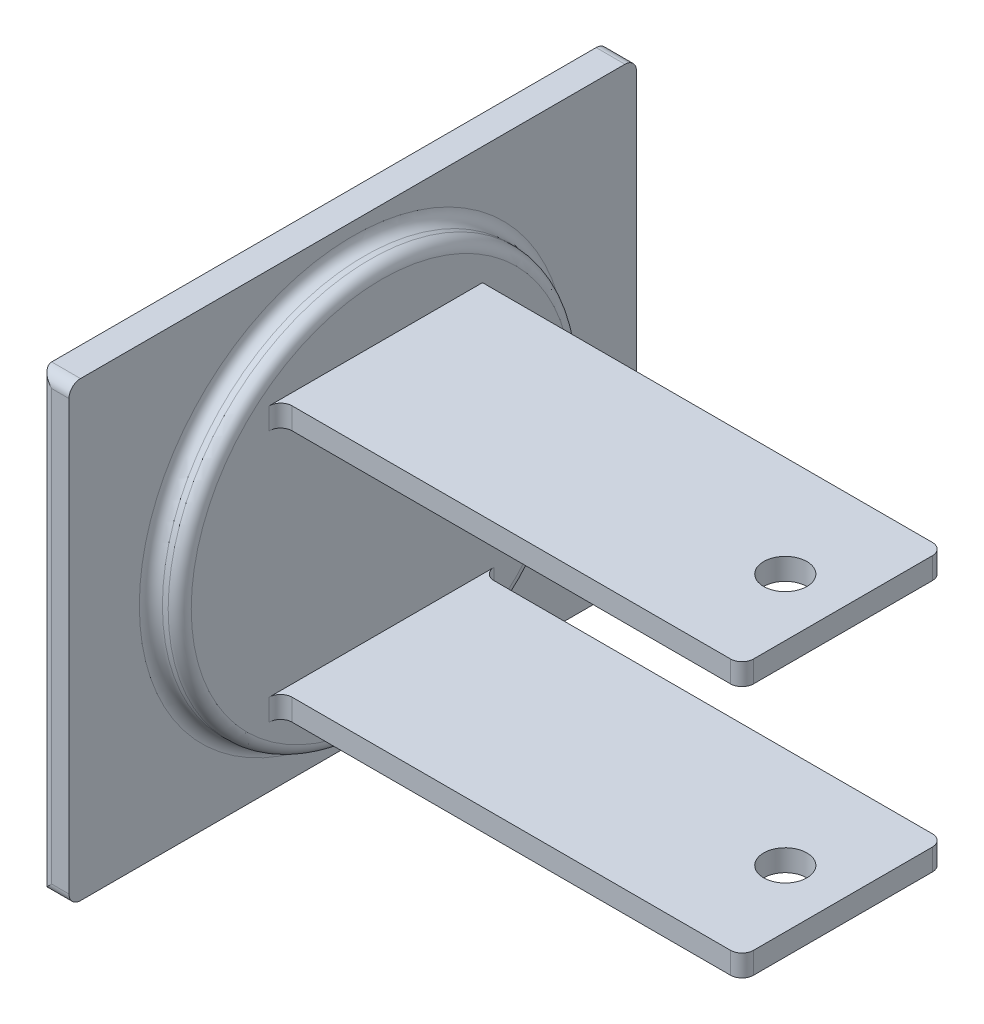
ISO-10303-21;
HEADER;
FILE_DESCRIPTION(('STEP AP214'),'2;1');
FILE_NAME('part.step','',(''),(''),'','','');
FILE_SCHEMA(('AUTOMOTIVE_DESIGN { 1 0 10303 214 1 1 1 1 }'));
ENDSEC;
DATA;
#1=APPLICATION_CONTEXT('core data for automotive mechanical design processes');
#2=APPLICATION_PROTOCOL_DEFINITION('international standard','automotive_design',2000,#1);
#3=PRODUCT_CONTEXT('',#1,'mechanical');
#4=PRODUCT('Part','Part','',(#3));
#5=PRODUCT_RELATED_PRODUCT_CATEGORY('part','',(#4));
#6=PRODUCT_DEFINITION_FORMATION('','',#4);
#7=PRODUCT_DEFINITION_CONTEXT('part definition',#1,'design');
#8=PRODUCT_DEFINITION('design','',#6,#7);
#9=PRODUCT_DEFINITION_SHAPE('','',#8);
#10=(LENGTH_UNIT() NAMED_UNIT(*) SI_UNIT(.MILLI.,.METRE.));
#11=(NAMED_UNIT(*) PLANE_ANGLE_UNIT() SI_UNIT($,.RADIAN.));
#12=(NAMED_UNIT(*) SI_UNIT($,.STERADIAN.) SOLID_ANGLE_UNIT());
#13=UNCERTAINTY_MEASURE_WITH_UNIT(LENGTH_MEASURE(1.E-05),#10,'distance_accuracy_value','');
#14=(GEOMETRIC_REPRESENTATION_CONTEXT(3) GLOBAL_UNCERTAINTY_ASSIGNED_CONTEXT((#13)) GLOBAL_UNIT_ASSIGNED_CONTEXT((#10,
#11,#12)) REPRESENTATION_CONTEXT('',''));
#15=CARTESIAN_POINT('',(0.,0.,0.));
#16=DIRECTION('',(0.,0.,1.));
#17=DIRECTION('',(1.,0.,0.));
#18=AXIS2_PLACEMENT_3D('',#15,#16,#17);
#19=CARTESIAN_POINT('',(12.7,49.784,-62.484));
#20=DIRECTION('',(1.,0.,0.));
#21=DIRECTION('',(0.,0.,-1.));
#22=AXIS2_PLACEMENT_3D('',#19,#20,#21);
#23=PLANE('',#22);
#24=CARTESIAN_POINT('',(12.7,49.784,-62.484));
#25=DIRECTION('',(1.,0.,0.));
#26=DIRECTION('',(0.,0.,-1.));
#27=AXIS2_PLACEMENT_3D('',#24,#25,#26);
#28=CIRCLE('',#27,41.91);
#29=CARTESIAN_POINT('',(12.7,49.784,-104.394));
#30=VERTEX_POINT('',#29);
#31=EDGE_CURVE('E289',#30,#30,#28,.T.);
#32=ORIENTED_EDGE('',*,*,#31,.T.);
#33=EDGE_LOOP('',(#32));
#34=FACE_BOUND('',#33,.T.);
#35=DIRECTION('',(0.,0.,-1.));
#36=VECTOR('',#35,1.);
#37=CARTESIAN_POINT('',(12.7,75.184,-40.259));
#38=LINE('',#37,#36);
#39=CARTESIAN_POINT('',(12.7,75.184,-37.719));
#40=VERTEX_POINT('',#39);
#41=CARTESIAN_POINT('',(12.7,75.184,-84.709));
#42=VERTEX_POINT('',#41);
#43=EDGE_CURVE('E219',#40,#42,#38,.T.);
#44=ORIENTED_EDGE('',*,*,#43,.F.);
#45=DIRECTION('',(0.,-1.,0.));
#46=VECTOR('',#45,1.);
#47=CARTESIAN_POINT('',(12.7,49.784,-37.719));
#48=LINE('',#47,#46);
#49=CARTESIAN_POINT('',(12.7,79.9465,-37.719));
#50=VERTEX_POINT('',#49);
#51=EDGE_CURVE('E217',#40,#50,#48,.F.);
#52=ORIENTED_EDGE('',*,*,#51,.T.);
#53=DIRECTION('',(0.,0.,1.));
#54=VECTOR('',#53,1.);
#55=CARTESIAN_POINT('',(12.7,79.9465,-40.259));
#56=LINE('',#55,#54);
#57=CARTESIAN_POINT('',(12.7,79.9465,-84.709));
#58=VERTEX_POINT('',#57);
#59=EDGE_CURVE('E197',#58,#50,#56,.T.);
#60=ORIENTED_EDGE('',*,*,#59,.F.);
#61=DIRECTION('',(0.,1.,0.));
#62=VECTOR('',#61,1.);
#63=CARTESIAN_POINT('',(12.7,79.9465,-84.709));
#64=LINE('',#63,#62);
#65=EDGE_CURVE('E207',#42,#58,#64,.T.);
#66=ORIENTED_EDGE('',*,*,#65,.F.);
#67=EDGE_LOOP('',(#44,#52,#60,#66));
#68=FACE_BOUND('',#67,.T.);
#69=DIRECTION('',(0.,0.,1.));
#70=VECTOR('',#69,1.);
#71=CARTESIAN_POINT('',(12.7,24.384,-40.259));
#72=LINE('',#71,#70);
#73=CARTESIAN_POINT('',(12.7,24.384,-87.249));
#74=VERTEX_POINT('',#73);
#75=CARTESIAN_POINT('',(12.7,24.384,-37.719));
#76=VERTEX_POINT('',#75);
#77=EDGE_CURVE('E381',#74,#76,#72,.T.);
#78=ORIENTED_EDGE('',*,*,#77,.F.);
#79=DIRECTION('',(0.,1.,0.));
#80=VECTOR('',#79,1.);
#81=CARTESIAN_POINT('',(12.7,49.784,-87.249));
#82=LINE('',#81,#80);
#83=CARTESIAN_POINT('',(12.7,19.6215,-87.249));
#84=VERTEX_POINT('',#83);
#85=EDGE_CURVE('E286',#74,#84,#82,.F.);
#86=ORIENTED_EDGE('',*,*,#85,.T.);
#87=DIRECTION('',(0.,0.,-1.));
#88=VECTOR('',#87,1.);
#89=CARTESIAN_POINT('',(12.7,19.6215,-40.259));
#90=LINE('',#89,#88);
#91=CARTESIAN_POINT('',(12.7,19.6215,-37.719));
#92=VERTEX_POINT('',#91);
#93=EDGE_CURVE('E386',#92,#84,#90,.T.);
#94=ORIENTED_EDGE('',*,*,#93,.F.);
#95=DIRECTION('',(0.,-1.,0.));
#96=VECTOR('',#95,1.);
#97=CARTESIAN_POINT('',(12.7,49.784,-37.719));
#98=LINE('',#97,#96);
#99=EDGE_CURVE('E283',#92,#76,#98,.F.);
#100=ORIENTED_EDGE('',*,*,#99,.T.);
#101=EDGE_LOOP('',(#78,#86,#94,#100));
#102=FACE_BOUND('',#101,.T.);
#103=ADVANCED_FACE('F34',(#34,#68,#102),#23,.T.);
#104=CARTESIAN_POINT('',(6.35,0.,0.));
#105=DIRECTION('',(0.,0.,-1.));
#106=DIRECTION('',(0.,1.,0.));
#107=AXIS2_PLACEMENT_3D('',#104,#105,#106);
#108=PLANE('',#107);
#109=DIRECTION('',(0.,-1.,0.));
#110=VECTOR('',#109,1.);
#111=CARTESIAN_POINT('',(2.54,0.,0.));
#112=LINE('',#111,#110);
#113=CARTESIAN_POINT('',(2.54,97.028,0.));
#114=VERTEX_POINT('',#113);
#115=CARTESIAN_POINT('',(2.54,2.54,0.));
#116=VERTEX_POINT('',#115);
#117=EDGE_CURVE('E271',#114,#116,#112,.T.);
#118=ORIENTED_EDGE('',*,*,#117,.T.);
#119=DIRECTION('',(-1.,0.,0.));
#120=VECTOR('',#119,1.);
#121=CARTESIAN_POINT('',(6.35,2.54,0.));
#122=LINE('',#121,#120);
#123=CARTESIAN_POINT('',(6.35,2.54,0.));
#124=VERTEX_POINT('',#123);
#125=EDGE_CURVE('E274',#116,#124,#122,.F.);
#126=ORIENTED_EDGE('',*,*,#125,.T.);
#127=DIRECTION('',(0.,-1.,0.));
#128=VECTOR('',#127,1.);
#129=CARTESIAN_POINT('',(6.35,0.,0.));
#130=LINE('',#129,#128);
#131=CARTESIAN_POINT('',(6.35,97.028,0.));
#132=VERTEX_POINT('',#131);
#133=EDGE_CURVE('E232',#132,#124,#130,.T.);
#134=ORIENTED_EDGE('',*,*,#133,.F.);
#135=DIRECTION('',(-1.,0.,0.));
#136=VECTOR('',#135,1.);
#137=CARTESIAN_POINT('',(6.35,97.028,0.));
#138=LINE('',#137,#136);
#139=EDGE_CURVE('E269',#132,#114,#138,.T.);
#140=ORIENTED_EDGE('',*,*,#139,.T.);
#141=EDGE_LOOP('',(#118,#126,#134,#140));
#142=FACE_BOUND('',#141,.T.);
#143=ADVANCED_FACE('F435',(#142),#108,.F.);
#144=CARTESIAN_POINT('',(6.35,0.,0.));
#145=DIRECTION('',(0.,1.,0.));
#146=DIRECTION('',(0.,0.,1.));
#147=AXIS2_PLACEMENT_3D('',#144,#145,#146);
#148=PLANE('',#147);
#149=DIRECTION('',(0.,0.,-1.));
#150=VECTOR('',#149,1.);
#151=CARTESIAN_POINT('',(6.35,0.,0.));
#152=LINE('',#151,#150);
#153=CARTESIAN_POINT('',(6.35,0.,-2.54));
#154=VERTEX_POINT('',#153);
#155=CARTESIAN_POINT('',(6.35,0.,-122.428));
#156=VERTEX_POINT('',#155);
#157=EDGE_CURVE('E235',#154,#156,#152,.T.);
#158=ORIENTED_EDGE('',*,*,#157,.F.);
#159=DIRECTION('',(-1.,0.,0.));
#160=VECTOR('',#159,1.);
#161=CARTESIAN_POINT('',(6.35,0.,-2.54));
#162=LINE('',#161,#160);
#163=CARTESIAN_POINT('',(0.,0.,-2.54));
#164=VERTEX_POINT('',#163);
#165=EDGE_CURVE('E333',#154,#164,#162,.T.);
#166=ORIENTED_EDGE('',*,*,#165,.T.);
#167=DIRECTION('',(0.,0.,-1.));
#168=VECTOR('',#167,1.);
#169=CARTESIAN_POINT('',(0.,0.,0.));
#170=LINE('',#169,#168);
#171=CARTESIAN_POINT('',(0.,0.,-122.428));
#172=VERTEX_POINT('',#171);
#173=EDGE_CURVE('E203',#164,#172,#170,.T.);
#174=ORIENTED_EDGE('',*,*,#173,.T.);
#175=DIRECTION('',(-1.,0.,0.));
#176=VECTOR('',#175,1.);
#177=CARTESIAN_POINT('',(6.35,0.,-122.428));
#178=LINE('',#177,#176);
#179=EDGE_CURVE('E331',#172,#156,#178,.F.);
#180=ORIENTED_EDGE('',*,*,#179,.T.);
#181=EDGE_LOOP('',(#158,#166,#174,#180));
#182=FACE_BOUND('',#181,.T.);
#183=ADVANCED_FACE('F441',(#182),#148,.F.);
#184=CARTESIAN_POINT('',(6.35,0.,-124.968));
#185=DIRECTION('',(0.,0.,1.));
#186=DIRECTION('',(0.,-1.,0.));
#187=AXIS2_PLACEMENT_3D('',#184,#185,#186);
#188=PLANE('',#187);
#189=DIRECTION('',(0.,1.,0.));
#190=VECTOR('',#189,1.);
#191=CARTESIAN_POINT('',(6.35,0.,-124.968));
#192=LINE('',#191,#190);
#193=CARTESIAN_POINT('',(6.35,2.54,-124.968));
#194=VERTEX_POINT('',#193);
#195=CARTESIAN_POINT('',(6.35,97.028,-124.968));
#196=VERTEX_POINT('',#195);
#197=EDGE_CURVE('E239',#194,#196,#192,.T.);
#198=ORIENTED_EDGE('',*,*,#197,.F.);
#199=DIRECTION('',(-1.,0.,0.));
#200=VECTOR('',#199,1.);
#201=CARTESIAN_POINT('',(6.35,2.54,-124.968));
#202=LINE('',#201,#200);
#203=CARTESIAN_POINT('',(0.,2.54,-124.968));
#204=VERTEX_POINT('',#203);
#205=EDGE_CURVE('E339',#194,#204,#202,.T.);
#206=ORIENTED_EDGE('',*,*,#205,.T.);
#207=DIRECTION('',(0.,1.,0.));
#208=VECTOR('',#207,1.);
#209=CARTESIAN_POINT('',(0.,0.,-124.968));
#210=LINE('',#209,#208);
#211=CARTESIAN_POINT('',(0.,97.028,-124.968));
#212=VERTEX_POINT('',#211);
#213=EDGE_CURVE('E248',#204,#212,#210,.T.);
#214=ORIENTED_EDGE('',*,*,#213,.T.);
#215=DIRECTION('',(-1.,0.,0.));
#216=VECTOR('',#215,1.);
#217=CARTESIAN_POINT('',(6.35,97.028,-124.968));
#218=LINE('',#217,#216);
#219=EDGE_CURVE('E337',#212,#196,#218,.F.);
#220=ORIENTED_EDGE('',*,*,#219,.T.);
#221=EDGE_LOOP('',(#198,#206,#214,#220));
#222=FACE_BOUND('',#221,.T.);
#223=ADVANCED_FACE('F462',(#222),#188,.F.);
#224=CARTESIAN_POINT('',(6.35,99.568,0.));
#225=DIRECTION('',(0.,-1.,0.));
#226=DIRECTION('',(0.,0.,-1.));
#227=AXIS2_PLACEMENT_3D('',#224,#225,#226);
#228=PLANE('',#227);
#229=DIRECTION('',(0.,0.,1.));
#230=VECTOR('',#229,1.);
#231=CARTESIAN_POINT('',(0.,99.568,0.));
#232=LINE('',#231,#230);
#233=CARTESIAN_POINT('',(0.,99.568,-122.428));
#234=VERTEX_POINT('',#233);
#235=CARTESIAN_POINT('',(0.,99.568,-2.53999999999999));
#236=VERTEX_POINT('',#235);
#237=EDGE_CURVE('E236',#234,#236,#232,.T.);
#238=ORIENTED_EDGE('',*,*,#237,.T.);
#239=DIRECTION('',(-1.,0.,0.));
#240=VECTOR('',#239,1.);
#241=CARTESIAN_POINT('',(6.35,99.568,-2.53999999999999));
#242=LINE('',#241,#240);
#243=CARTESIAN_POINT('',(6.35,99.568,-2.53999999999999));
#244=VERTEX_POINT('',#243);
#245=EDGE_CURVE('E345',#236,#244,#242,.F.);
#246=ORIENTED_EDGE('',*,*,#245,.T.);
#247=DIRECTION('',(0.,0.,1.));
#248=VECTOR('',#247,1.);
#249=CARTESIAN_POINT('',(6.35,99.568,0.));
#250=LINE('',#249,#248);
#251=CARTESIAN_POINT('',(6.35,99.568,-122.428));
#252=VERTEX_POINT('',#251);
#253=EDGE_CURVE('E242',#252,#244,#250,.T.);
#254=ORIENTED_EDGE('',*,*,#253,.F.);
#255=DIRECTION('',(-1.,0.,0.));
#256=VECTOR('',#255,1.);
#257=CARTESIAN_POINT('',(6.35,99.568,-122.428));
#258=LINE('',#257,#256);
#259=EDGE_CURVE('E342',#252,#234,#258,.T.);
#260=ORIENTED_EDGE('',*,*,#259,.T.);
#261=EDGE_LOOP('',(#238,#246,#254,#260));
#262=FACE_BOUND('',#261,.T.);
#263=ADVANCED_FACE('F455',(#262),#228,.F.);
#264=CARTESIAN_POINT('',(6.35,0.,0.));
#265=DIRECTION('',(-1.,0.,0.));
#266=DIRECTION('',(0.,0.,1.));
#267=AXIS2_PLACEMENT_3D('',#264,#265,#266);
#268=PLANE('',#267);
#269=CARTESIAN_POINT('',(6.35,49.784,-62.484));
#270=DIRECTION('',(-1.,0.,0.));
#271=DIRECTION('',(0.,0.,1.));
#272=AXIS2_PLACEMENT_3D('',#269,#270,#271);
#273=CIRCLE('',#272,46.99);
#274=CARTESIAN_POINT('',(6.35,49.784,-15.494));
#275=VERTEX_POINT('',#274);
#276=EDGE_CURVE('E266',#275,#275,#273,.T.);
#277=ORIENTED_EDGE('',*,*,#276,.T.);
#278=EDGE_LOOP('',(#277));
#279=FACE_BOUND('',#278,.T.);
#280=ORIENTED_EDGE('',*,*,#133,.T.);
#281=CARTESIAN_POINT('',(6.35,2.54,-2.54));
#282=DIRECTION('',(-1.,0.,0.));
#283=DIRECTION('',(0.,0.,1.));
#284=AXIS2_PLACEMENT_3D('',#281,#282,#283);
#285=CIRCLE('',#284,2.54);
#286=EDGE_CURVE('E264',#124,#154,#285,.F.);
#287=ORIENTED_EDGE('',*,*,#286,.T.);
#288=ORIENTED_EDGE('',*,*,#157,.T.);
#289=CARTESIAN_POINT('',(6.35,2.54,-122.428));
#290=DIRECTION('',(-1.,0.,0.));
#291=DIRECTION('',(0.,0.,1.));
#292=AXIS2_PLACEMENT_3D('',#289,#290,#291);
#293=CIRCLE('',#292,2.54);
#294=EDGE_CURVE('E262',#156,#194,#293,.F.);
#295=ORIENTED_EDGE('',*,*,#294,.T.);
#296=ORIENTED_EDGE('',*,*,#197,.T.);
#297=CARTESIAN_POINT('',(6.35,97.028,-122.428));
#298=DIRECTION('',(-1.,0.,0.));
#299=DIRECTION('',(0.,0.,1.));
#300=AXIS2_PLACEMENT_3D('',#297,#298,#299);
#301=CIRCLE('',#300,2.54);
#302=EDGE_CURVE('E258',#196,#252,#301,.F.);
#303=ORIENTED_EDGE('',*,*,#302,.T.);
#304=ORIENTED_EDGE('',*,*,#253,.T.);
#305=CARTESIAN_POINT('',(6.35,97.028,-2.53999999999999));
#306=DIRECTION('',(-1.,0.,0.));
#307=DIRECTION('',(0.,0.,1.));
#308=AXIS2_PLACEMENT_3D('',#305,#306,#307);
#309=CIRCLE('',#308,2.54);
#310=EDGE_CURVE('E260',#244,#132,#309,.F.);
#311=ORIENTED_EDGE('',*,*,#310,.T.);
#312=EDGE_LOOP('',(#280,#287,#288,#295,#296,#303,#304,#311));
#313=FACE_BOUND('',#312,.T.);
#314=ADVANCED_FACE('F452',(#279,#313),#268,.F.);
#315=CARTESIAN_POINT('',(0.,0.,0.));
#316=DIRECTION('',(-1.,0.,0.));
#317=DIRECTION('',(0.,0.,1.));
#318=AXIS2_PLACEMENT_3D('',#315,#316,#317);
#319=PLANE('',#318);
#320=ORIENTED_EDGE('',*,*,#173,.F.);
#321=DIRECTION('',(0.,-1.,0.));
#322=VECTOR('',#321,1.);
#323=CARTESIAN_POINT('',(0.,99.568,-2.53999999999999));
#324=LINE('',#323,#322);
#325=EDGE_CURVE('E280',#164,#236,#324,.F.);
#326=ORIENTED_EDGE('',*,*,#325,.T.);
#327=ORIENTED_EDGE('',*,*,#237,.F.);
#328=CARTESIAN_POINT('',(0.,97.028,-122.428));
#329=DIRECTION('',(-1.,0.,0.));
#330=DIRECTION('',(0.,0.,1.));
#331=AXIS2_PLACEMENT_3D('',#328,#329,#330);
#332=CIRCLE('',#331,2.54);
#333=EDGE_CURVE('E276',#234,#212,#332,.T.);
#334=ORIENTED_EDGE('',*,*,#333,.T.);
#335=ORIENTED_EDGE('',*,*,#213,.F.);
#336=CARTESIAN_POINT('',(0.,2.54,-122.428));
#337=DIRECTION('',(-1.,0.,0.));
#338=DIRECTION('',(0.,0.,1.));
#339=AXIS2_PLACEMENT_3D('',#336,#337,#338);
#340=CIRCLE('',#339,2.54);
#341=EDGE_CURVE('E278',#204,#172,#340,.T.);
#342=ORIENTED_EDGE('',*,*,#341,.T.);
#343=EDGE_LOOP('',(#320,#326,#327,#334,#335,#342));
#344=FACE_BOUND('',#343,.T.);
#345=ADVANCED_FACE('F450',(#344),#319,.T.);
#346=CARTESIAN_POINT('',(12.7,49.784,-62.484));
#347=DIRECTION('',(-1.,0.,0.));
#348=DIRECTION('',(0.,0.,1.));
#349=AXIS2_PLACEMENT_3D('',#346,#347,#348);
#350=CYLINDRICAL_SURFACE('',#349,44.45);
#351=CARTESIAN_POINT('',(8.89,49.784,-62.484));
#352=DIRECTION('',(-1.,0.,0.));
#353=DIRECTION('',(0.,0.,1.));
#354=AXIS2_PLACEMENT_3D('',#351,#352,#353);
#355=CIRCLE('',#354,44.45);
#356=CARTESIAN_POINT('',(8.89,49.784,-18.034));
#357=VERTEX_POINT('',#356);
#358=EDGE_CURVE('E255',#357,#357,#355,.F.);
#359=ORIENTED_EDGE('',*,*,#358,.T.);
#360=EDGE_LOOP('',(#359));
#361=FACE_BOUND('',#360,.T.);
#362=CARTESIAN_POINT('',(10.16,49.784,-62.484));
#363=DIRECTION('',(1.,0.,0.));
#364=DIRECTION('',(0.,0.,-1.));
#365=AXIS2_PLACEMENT_3D('',#362,#363,#364);
#366=CIRCLE('',#365,44.45);
#367=CARTESIAN_POINT('',(10.16,49.784,-106.934));
#368=VERTEX_POINT('',#367);
#369=EDGE_CURVE('E245',#368,#368,#366,.F.);
#370=ORIENTED_EDGE('',*,*,#369,.T.);
#371=EDGE_LOOP('',(#370));
#372=FACE_BOUND('',#371,.T.);
#373=ADVANCED_FACE('F447',(#361,#372),#350,.T.);
#374=CARTESIAN_POINT('',(114.3,79.9465,-84.709));
#375=DIRECTION('',(0.,0.,1.));
#376=DIRECTION('',(1.,0.,0.));
#377=AXIS2_PLACEMENT_3D('',#374,#375,#376);
#378=PLANE('',#377);
#379=DIRECTION('',(-1.,0.,0.));
#380=VECTOR('',#379,1.);
#381=CARTESIAN_POINT('',(114.3,79.9465,-84.709));
#382=LINE('',#381,#380);
#383=CARTESIAN_POINT('',(111.76,79.9465,-84.709));
#384=VERTEX_POINT('',#383);
#385=EDGE_CURVE('E192',#384,#58,#382,.T.);
#386=ORIENTED_EDGE('',*,*,#385,.F.);
#387=DIRECTION('',(0.,1.,0.));
#388=VECTOR('',#387,1.);
#389=CARTESIAN_POINT('',(111.76,75.184,-84.709));
#390=LINE('',#389,#388);
#391=CARTESIAN_POINT('',(111.76,75.184,-84.709));
#392=VERTEX_POINT('',#391);
#393=EDGE_CURVE('E335',#384,#392,#390,.F.);
#394=ORIENTED_EDGE('',*,*,#393,.T.);
#395=DIRECTION('',(-1.,0.,0.));
#396=VECTOR('',#395,1.);
#397=CARTESIAN_POINT('',(114.3,75.184,-84.709));
#398=LINE('',#397,#396);
#399=EDGE_CURVE('E210',#392,#42,#398,.T.);
#400=ORIENTED_EDGE('',*,*,#399,.T.);
#401=ORIENTED_EDGE('',*,*,#65,.T.);
#402=EDGE_LOOP('',(#386,#394,#400,#401));
#403=FACE_BOUND('',#402,.T.);
#404=ADVANCED_FACE('F208',(#403),#378,.F.);
#405=CARTESIAN_POINT('',(114.3,79.9465,-40.259));
#406=DIRECTION('',(0.,-1.,0.));
#407=DIRECTION('',(0.,0.,-1.));
#408=AXIS2_PLACEMENT_3D('',#405,#406,#407);
#409=PLANE('',#408);
#410=CARTESIAN_POINT('',(101.6,79.9465,-62.484));
#411=DIRECTION('',(0.,-1.,0.));
#412=DIRECTION('',(0.,0.,-1.));
#413=AXIS2_PLACEMENT_3D('',#410,#411,#412);
#414=CIRCLE('',#413,4.7625);
#415=CARTESIAN_POINT('',(101.6,79.9465,-67.2465));
#416=VERTEX_POINT('',#415);
#417=EDGE_CURVE('E378',#416,#416,#414,.T.);
#418=ORIENTED_EDGE('',*,*,#417,.T.);
#419=EDGE_LOOP('',(#418));
#420=FACE_BOUND('',#419,.T.);
#421=DIRECTION('',(-1.,0.,0.));
#422=VECTOR('',#421,1.);
#423=CARTESIAN_POINT('',(114.3,79.9465,-40.259));
#424=LINE('',#423,#422);
#425=CARTESIAN_POINT('',(111.76,79.9465,-40.259));
#426=VERTEX_POINT('',#425);
#427=CARTESIAN_POINT('',(15.24,79.9465,-40.259));
#428=VERTEX_POINT('',#427);
#429=EDGE_CURVE('E204',#426,#428,#424,.T.);
#430=ORIENTED_EDGE('',*,*,#429,.F.);
#431=CARTESIAN_POINT('',(111.76,79.9465,-42.799));
#432=DIRECTION('',(0.,-1.,0.));
#433=DIRECTION('',(0.,0.,-1.));
#434=AXIS2_PLACEMENT_3D('',#431,#432,#433);
#435=CIRCLE('',#434,2.54);
#436=CARTESIAN_POINT('',(114.3,79.9465,-42.799));
#437=VERTEX_POINT('',#436);
#438=EDGE_CURVE('E318',#426,#437,#435,.F.);
#439=ORIENTED_EDGE('',*,*,#438,.T.);
#440=DIRECTION('',(0.,0.,1.));
#441=VECTOR('',#440,1.);
#442=CARTESIAN_POINT('',(114.3,79.9465,-40.259));
#443=LINE('',#442,#441);
#444=CARTESIAN_POINT('',(114.3,79.9465,-82.169));
#445=VERTEX_POINT('',#444);
#446=EDGE_CURVE('E221',#445,#437,#443,.T.);
#447=ORIENTED_EDGE('',*,*,#446,.F.);
#448=CARTESIAN_POINT('',(111.76,79.9465,-82.169));
#449=DIRECTION('',(0.,-1.,0.));
#450=DIRECTION('',(0.,0.,-1.));
#451=AXIS2_PLACEMENT_3D('',#448,#449,#450);
#452=CIRCLE('',#451,2.54);
#453=EDGE_CURVE('E200',#445,#384,#452,.F.);
#454=ORIENTED_EDGE('',*,*,#453,.T.);
#455=ORIENTED_EDGE('',*,*,#385,.T.);
#456=ORIENTED_EDGE('',*,*,#59,.T.);
#457=CARTESIAN_POINT('',(15.24,79.9465,-37.719));
#458=DIRECTION('',(0.,-1.,0.));
#459=DIRECTION('',(0.,0.,-1.));
#460=AXIS2_PLACEMENT_3D('',#457,#458,#459);
#461=CIRCLE('',#460,2.54);
#462=EDGE_CURVE('E11',#50,#428,#461,.T.);
#463=ORIENTED_EDGE('',*,*,#462,.T.);
#464=EDGE_LOOP('',(#430,#439,#447,#454,#455,#456,#463));
#465=FACE_BOUND('',#464,.T.);
#466=ADVANCED_FACE('F195',(#420,#465),#409,.F.);
#467=CARTESIAN_POINT('',(114.3,79.9465,-40.259));
#468=DIRECTION('',(0.,0.,-1.));
#469=DIRECTION('',(-1.,0.,0.));
#470=AXIS2_PLACEMENT_3D('',#467,#468,#469);
#471=PLANE('',#470);
#472=ORIENTED_EDGE('',*,*,#429,.T.);
#473=DIRECTION('',(0.,-1.,0.));
#474=VECTOR('',#473,1.);
#475=CARTESIAN_POINT('',(15.24,79.9465,-40.259));
#476=LINE('',#475,#474);
#477=CARTESIAN_POINT('',(15.24,75.184,-40.259));
#478=VERTEX_POINT('',#477);
#479=EDGE_CURVE('E304',#428,#478,#476,.T.);
#480=ORIENTED_EDGE('',*,*,#479,.T.);
#481=DIRECTION('',(-1.,0.,0.));
#482=VECTOR('',#481,1.);
#483=CARTESIAN_POINT('',(114.3,75.184,-40.259));
#484=LINE('',#483,#482);
#485=CARTESIAN_POINT('',(111.76,75.184,-40.259));
#486=VERTEX_POINT('',#485);
#487=EDGE_CURVE('E226',#486,#478,#484,.T.);
#488=ORIENTED_EDGE('',*,*,#487,.F.);
#489=DIRECTION('',(0.,-1.,0.));
#490=VECTOR('',#489,1.);
#491=CARTESIAN_POINT('',(111.76,79.9465,-40.259));
#492=LINE('',#491,#490);
#493=EDGE_CURVE('E302',#486,#426,#492,.F.);
#494=ORIENTED_EDGE('',*,*,#493,.T.);
#495=EDGE_LOOP('',(#472,#480,#488,#494));
#496=FACE_BOUND('',#495,.T.);
#497=ADVANCED_FACE('F419',(#496),#471,.F.);
#498=CARTESIAN_POINT('',(114.3,75.184,-40.259));
#499=DIRECTION('',(0.,1.,0.));
#500=DIRECTION('',(0.,0.,1.));
#501=AXIS2_PLACEMENT_3D('',#498,#499,#500);
#502=PLANE('',#501);
#503=CARTESIAN_POINT('',(101.6,75.184,-62.484));
#504=DIRECTION('',(0.,1.,0.));
#505=DIRECTION('',(0.,0.,1.));
#506=AXIS2_PLACEMENT_3D('',#503,#504,#505);
#507=CIRCLE('',#506,4.7625);
#508=CARTESIAN_POINT('',(101.6,75.184,-57.7215));
#509=VERTEX_POINT('',#508);
#510=EDGE_CURVE('E373',#509,#509,#507,.T.);
#511=ORIENTED_EDGE('',*,*,#510,.T.);
#512=EDGE_LOOP('',(#511));
#513=FACE_BOUND('',#512,.T.);
#514=DIRECTION('',(0.,0.,-1.));
#515=VECTOR('',#514,1.);
#516=CARTESIAN_POINT('',(114.3,75.184,-40.259));
#517=LINE('',#516,#515);
#518=CARTESIAN_POINT('',(114.3,75.184,-42.799));
#519=VERTEX_POINT('',#518);
#520=CARTESIAN_POINT('',(114.3,75.184,-82.169));
#521=VERTEX_POINT('',#520);
#522=EDGE_CURVE('E227',#519,#521,#517,.T.);
#523=ORIENTED_EDGE('',*,*,#522,.F.);
#524=CARTESIAN_POINT('',(111.76,75.184,-42.799));
#525=DIRECTION('',(0.,1.,0.));
#526=DIRECTION('',(0.,0.,1.));
#527=AXIS2_PLACEMENT_3D('',#524,#525,#526);
#528=CIRCLE('',#527,2.54);
#529=EDGE_CURVE('E315',#519,#486,#528,.F.);
#530=ORIENTED_EDGE('',*,*,#529,.T.);
#531=ORIENTED_EDGE('',*,*,#487,.T.);
#532=CARTESIAN_POINT('',(15.24,75.184,-37.719));
#533=DIRECTION('',(0.,1.,0.));
#534=DIRECTION('',(0.,0.,1.));
#535=AXIS2_PLACEMENT_3D('',#532,#533,#534);
#536=CIRCLE('',#535,2.54);
#537=EDGE_CURVE('E43',#478,#40,#536,.T.);
#538=ORIENTED_EDGE('',*,*,#537,.T.);
#539=ORIENTED_EDGE('',*,*,#43,.T.);
#540=ORIENTED_EDGE('',*,*,#399,.F.);
#541=CARTESIAN_POINT('',(111.76,75.184,-82.169));
#542=DIRECTION('',(0.,1.,0.));
#543=DIRECTION('',(0.,0.,1.));
#544=AXIS2_PLACEMENT_3D('',#541,#542,#543);
#545=CIRCLE('',#544,2.54);
#546=EDGE_CURVE('E313',#392,#521,#545,.F.);
#547=ORIENTED_EDGE('',*,*,#546,.T.);
#548=EDGE_LOOP('',(#523,#530,#531,#538,#539,#540,#547));
#549=FACE_BOUND('',#548,.T.);
#550=ADVANCED_FACE('F412',(#513,#549),#502,.F.);
#551=CARTESIAN_POINT('',(114.3,0.,0.));
#552=DIRECTION('',(1.,0.,0.));
#553=DIRECTION('',(0.,0.,-1.));
#554=AXIS2_PLACEMENT_3D('',#551,#552,#553);
#555=PLANE('',#554);
#556=ORIENTED_EDGE('',*,*,#446,.T.);
#557=DIRECTION('',(0.,-1.,0.));
#558=VECTOR('',#557,1.);
#559=CARTESIAN_POINT('',(114.3,75.184,-42.799));
#560=LINE('',#559,#558);
#561=EDGE_CURVE('E310',#437,#519,#560,.T.);
#562=ORIENTED_EDGE('',*,*,#561,.T.);
#563=ORIENTED_EDGE('',*,*,#522,.T.);
#564=DIRECTION('',(0.,1.,0.));
#565=VECTOR('',#564,1.);
#566=CARTESIAN_POINT('',(114.3,79.9465,-82.169));
#567=LINE('',#566,#565);
#568=EDGE_CURVE('E307',#521,#445,#567,.T.);
#569=ORIENTED_EDGE('',*,*,#568,.T.);
#570=EDGE_LOOP('',(#556,#562,#563,#569));
#571=FACE_BOUND('',#570,.T.);
#572=ADVANCED_FACE('F406',(#571),#555,.T.);
#573=CARTESIAN_POINT('',(114.3,19.6215,-84.709));
#574=DIRECTION('',(0.,0.,1.));
#575=DIRECTION('',(1.,0.,0.));
#576=AXIS2_PLACEMENT_3D('',#573,#574,#575);
#577=PLANE('',#576);
#578=DIRECTION('',(-1.,0.,0.));
#579=VECTOR('',#578,1.);
#580=CARTESIAN_POINT('',(114.3,19.6215,-84.709));
#581=LINE('',#580,#579);
#582=CARTESIAN_POINT('',(111.76,19.6215,-84.709));
#583=VERTEX_POINT('',#582);
#584=CARTESIAN_POINT('',(15.24,19.6215,-84.709));
#585=VERTEX_POINT('',#584);
#586=EDGE_CURVE('E388',#583,#585,#581,.T.);
#587=ORIENTED_EDGE('',*,*,#586,.T.);
#588=DIRECTION('',(0.,1.,0.));
#589=VECTOR('',#588,1.);
#590=CARTESIAN_POINT('',(15.24,19.6215,-84.709));
#591=LINE('',#590,#589);
#592=CARTESIAN_POINT('',(15.24,24.384,-84.709));
#593=VERTEX_POINT('',#592);
#594=EDGE_CURVE('E294',#585,#593,#591,.T.);
#595=ORIENTED_EDGE('',*,*,#594,.T.);
#596=DIRECTION('',(-1.,0.,0.));
#597=VECTOR('',#596,1.);
#598=CARTESIAN_POINT('',(114.3,24.384,-84.709));
#599=LINE('',#598,#597);
#600=CARTESIAN_POINT('',(111.76,24.384,-84.709));
#601=VERTEX_POINT('',#600);
#602=EDGE_CURVE('E213',#601,#593,#599,.T.);
#603=ORIENTED_EDGE('',*,*,#602,.F.);
#604=DIRECTION('',(0.,1.,0.));
#605=VECTOR('',#604,1.);
#606=CARTESIAN_POINT('',(111.76,19.6215,-84.709));
#607=LINE('',#606,#605);
#608=EDGE_CURVE('E292',#601,#583,#607,.F.);
#609=ORIENTED_EDGE('',*,*,#608,.T.);
#610=EDGE_LOOP('',(#587,#595,#603,#609));
#611=FACE_BOUND('',#610,.T.);
#612=ADVANCED_FACE('F516',(#611),#577,.F.);
#613=CARTESIAN_POINT('',(114.3,24.384,-40.259));
#614=DIRECTION('',(0.,-1.,0.));
#615=DIRECTION('',(0.,0.,-1.));
#616=AXIS2_PLACEMENT_3D('',#613,#614,#615);
#617=PLANE('',#616);
#618=CARTESIAN_POINT('',(101.6,24.384,-62.484));
#619=DIRECTION('',(0.,-1.,0.));
#620=DIRECTION('',(0.,0.,-1.));
#621=AXIS2_PLACEMENT_3D('',#618,#619,#620);
#622=CIRCLE('',#621,4.7625);
#623=CARTESIAN_POINT('',(101.6,24.384,-67.2465));
#624=VERTEX_POINT('',#623);
#625=EDGE_CURVE('E368',#624,#624,#622,.T.);
#626=ORIENTED_EDGE('',*,*,#625,.T.);
#627=EDGE_LOOP('',(#626));
#628=FACE_BOUND('',#627,.T.);
#629=DIRECTION('',(-1.,0.,0.));
#630=VECTOR('',#629,1.);
#631=CARTESIAN_POINT('',(114.3,24.384,-40.259));
#632=LINE('',#631,#630);
#633=CARTESIAN_POINT('',(111.76,24.384,-40.259));
#634=VERTEX_POINT('',#633);
#635=CARTESIAN_POINT('',(15.24,24.384,-40.259));
#636=VERTEX_POINT('',#635);
#637=EDGE_CURVE('E396',#634,#636,#632,.T.);
#638=ORIENTED_EDGE('',*,*,#637,.F.);
#639=CARTESIAN_POINT('',(111.76,24.384,-42.799));
#640=DIRECTION('',(0.,-1.,0.));
#641=DIRECTION('',(0.,0.,-1.));
#642=AXIS2_PLACEMENT_3D('',#639,#640,#641);
#643=CIRCLE('',#642,2.54);
#644=CARTESIAN_POINT('',(114.3,24.384,-42.799));
#645=VERTEX_POINT('',#644);
#646=EDGE_CURVE('E329',#634,#645,#643,.F.);
#647=ORIENTED_EDGE('',*,*,#646,.T.);
#648=DIRECTION('',(0.,0.,1.));
#649=VECTOR('',#648,1.);
#650=CARTESIAN_POINT('',(114.3,24.384,-40.259));
#651=LINE('',#650,#649);
#652=CARTESIAN_POINT('',(114.3,24.384,-82.169));
#653=VERTEX_POINT('',#652);
#654=EDGE_CURVE('E382',#653,#645,#651,.T.);
#655=ORIENTED_EDGE('',*,*,#654,.F.);
#656=CARTESIAN_POINT('',(111.76,24.384,-82.169));
#657=DIRECTION('',(0.,-1.,0.));
#658=DIRECTION('',(0.,0.,-1.));
#659=AXIS2_PLACEMENT_3D('',#656,#657,#658);
#660=CIRCLE('',#659,2.54);
#661=EDGE_CURVE('E327',#653,#601,#660,.F.);
#662=ORIENTED_EDGE('',*,*,#661,.T.);
#663=ORIENTED_EDGE('',*,*,#602,.T.);
#664=CARTESIAN_POINT('',(15.24,24.384,-87.249));
#665=DIRECTION('',(0.,-1.,0.));
#666=DIRECTION('',(0.,0.,-1.));
#667=AXIS2_PLACEMENT_3D('',#664,#665,#666);
#668=CIRCLE('',#667,2.54);
#669=EDGE_CURVE('E347',#593,#74,#668,.T.);
#670=ORIENTED_EDGE('',*,*,#669,.T.);
#671=ORIENTED_EDGE('',*,*,#77,.T.);
#672=CARTESIAN_POINT('',(15.24,24.384,-37.719));
#673=DIRECTION('',(0.,-1.,0.));
#674=DIRECTION('',(0.,0.,-1.));
#675=AXIS2_PLACEMENT_3D('',#672,#673,#674);
#676=CIRCLE('',#675,2.54);
#677=EDGE_CURVE('E355',#76,#636,#676,.T.);
#678=ORIENTED_EDGE('',*,*,#677,.T.);
#679=EDGE_LOOP('',(#638,#647,#655,#662,#663,#670,#671,#678));
#680=FACE_BOUND('',#679,.T.);
#681=ADVANCED_FACE('F503',(#628,#680),#617,.F.);
#682=CARTESIAN_POINT('',(114.3,19.6215,-40.259));
#683=DIRECTION('',(0.,0.,-1.));
#684=DIRECTION('',(-1.,0.,0.));
#685=AXIS2_PLACEMENT_3D('',#682,#683,#684);
#686=PLANE('',#685);
#687=ORIENTED_EDGE('',*,*,#637,.T.);
#688=DIRECTION('',(0.,-1.,0.));
#689=VECTOR('',#688,1.);
#690=CARTESIAN_POINT('',(15.24,19.6215,-40.259));
#691=LINE('',#690,#689);
#692=CARTESIAN_POINT('',(15.24,19.6215,-40.259));
#693=VERTEX_POINT('',#692);
#694=EDGE_CURVE('E299',#636,#693,#691,.T.);
#695=ORIENTED_EDGE('',*,*,#694,.T.);
#696=DIRECTION('',(-1.,0.,0.));
#697=VECTOR('',#696,1.);
#698=CARTESIAN_POINT('',(114.3,19.6215,-40.259));
#699=LINE('',#698,#697);
#700=CARTESIAN_POINT('',(111.76,19.6215,-40.259));
#701=VERTEX_POINT('',#700);
#702=EDGE_CURVE('E393',#701,#693,#699,.T.);
#703=ORIENTED_EDGE('',*,*,#702,.F.);
#704=DIRECTION('',(0.,-1.,0.));
#705=VECTOR('',#704,1.);
#706=CARTESIAN_POINT('',(111.76,19.6215,-40.259));
#707=LINE('',#706,#705);
#708=EDGE_CURVE('E297',#701,#634,#707,.F.);
#709=ORIENTED_EDGE('',*,*,#708,.T.);
#710=EDGE_LOOP('',(#687,#695,#703,#709));
#711=FACE_BOUND('',#710,.T.);
#712=ADVANCED_FACE('F506',(#711),#686,.F.);
#713=CARTESIAN_POINT('',(114.3,19.6215,-40.259));
#714=DIRECTION('',(0.,1.,0.));
#715=DIRECTION('',(0.,0.,1.));
#716=AXIS2_PLACEMENT_3D('',#713,#714,#715);
#717=PLANE('',#716);
#718=CARTESIAN_POINT('',(101.6,19.6215,-62.484));
#719=DIRECTION('',(0.,-1.,0.));
#720=DIRECTION('',(0.,0.,-1.));
#721=AXIS2_PLACEMENT_3D('',#718,#719,#720);
#722=CIRCLE('',#721,4.7625);
#723=CARTESIAN_POINT('',(101.6,19.6215,-67.2465));
#724=VERTEX_POINT('',#723);
#725=EDGE_CURVE('E365',#724,#724,#722,.T.);
#726=ORIENTED_EDGE('',*,*,#725,.F.);
#727=EDGE_LOOP('',(#726));
#728=FACE_BOUND('',#727,.T.);
#729=DIRECTION('',(0.,0.,-1.));
#730=VECTOR('',#729,1.);
#731=CARTESIAN_POINT('',(114.3,19.6215,-40.259));
#732=LINE('',#731,#730);
#733=CARTESIAN_POINT('',(114.3,19.6215,-42.799));
#734=VERTEX_POINT('',#733);
#735=CARTESIAN_POINT('',(114.3,19.6215,-82.169));
#736=VERTEX_POINT('',#735);
#737=EDGE_CURVE('E385',#734,#736,#732,.T.);
#738=ORIENTED_EDGE('',*,*,#737,.F.);
#739=CARTESIAN_POINT('',(111.76,19.6215,-42.799));
#740=DIRECTION('',(0.,1.,0.));
#741=DIRECTION('',(0.,0.,1.));
#742=AXIS2_PLACEMENT_3D('',#739,#740,#741);
#743=CIRCLE('',#742,2.54);
#744=EDGE_CURVE('E59',#734,#701,#743,.F.);
#745=ORIENTED_EDGE('',*,*,#744,.T.);
#746=ORIENTED_EDGE('',*,*,#702,.T.);
#747=CARTESIAN_POINT('',(15.24,19.6215,-37.719));
#748=DIRECTION('',(0.,1.,0.));
#749=DIRECTION('',(0.,0.,1.));
#750=AXIS2_PLACEMENT_3D('',#747,#748,#749);
#751=CIRCLE('',#750,2.54);
#752=EDGE_CURVE('E352',#693,#92,#751,.T.);
#753=ORIENTED_EDGE('',*,*,#752,.T.);
#754=ORIENTED_EDGE('',*,*,#93,.T.);
#755=CARTESIAN_POINT('',(15.24,19.6215,-87.249));
#756=DIRECTION('',(0.,1.,0.));
#757=DIRECTION('',(0.,0.,1.));
#758=AXIS2_PLACEMENT_3D('',#755,#756,#757);
#759=CIRCLE('',#758,2.54);
#760=EDGE_CURVE('E350',#84,#585,#759,.T.);
#761=ORIENTED_EDGE('',*,*,#760,.T.);
#762=ORIENTED_EDGE('',*,*,#586,.F.);
#763=CARTESIAN_POINT('',(111.76,19.6215,-82.169));
#764=DIRECTION('',(0.,1.,0.));
#765=DIRECTION('',(0.,0.,1.));
#766=AXIS2_PLACEMENT_3D('',#763,#764,#765);
#767=CIRCLE('',#766,2.54);
#768=EDGE_CURVE('E51',#583,#736,#767,.F.);
#769=ORIENTED_EDGE('',*,*,#768,.T.);
#770=EDGE_LOOP('',(#738,#745,#746,#753,#754,#761,#762,#769));
#771=FACE_BOUND('',#770,.T.);
#772=ADVANCED_FACE('F520',(#728,#771),#717,.F.);
#773=CARTESIAN_POINT('',(114.3,0.,0.));
#774=DIRECTION('',(-1.,0.,0.));
#775=DIRECTION('',(0.,0.,1.));
#776=AXIS2_PLACEMENT_3D('',#773,#774,#775);
#777=PLANE('',#776);
#778=ORIENTED_EDGE('',*,*,#654,.T.);
#779=DIRECTION('',(0.,-1.,0.));
#780=VECTOR('',#779,1.);
#781=CARTESIAN_POINT('',(114.3,0.,-42.799));
#782=LINE('',#781,#780);
#783=EDGE_CURVE('E323',#645,#734,#782,.T.);
#784=ORIENTED_EDGE('',*,*,#783,.T.);
#785=ORIENTED_EDGE('',*,*,#737,.T.);
#786=DIRECTION('',(0.,1.,0.));
#787=VECTOR('',#786,1.);
#788=CARTESIAN_POINT('',(114.3,0.,-82.169));
#789=LINE('',#788,#787);
#790=EDGE_CURVE('E320',#736,#653,#789,.T.);
#791=ORIENTED_EDGE('',*,*,#790,.T.);
#792=EDGE_LOOP('',(#778,#784,#785,#791));
#793=FACE_BOUND('',#792,.T.);
#794=ADVANCED_FACE('F510',(#793),#777,.F.);
#795=CARTESIAN_POINT('',(101.6,99.568,-62.484));
#796=DIRECTION('',(0.,-1.,0.));
#797=DIRECTION('',(0.,0.,-1.));
#798=AXIS2_PLACEMENT_3D('',#795,#796,#797);
#799=CYLINDRICAL_SURFACE('',#798,4.7625);
#800=ORIENTED_EDGE('',*,*,#725,.T.);
#801=EDGE_LOOP('',(#800));
#802=FACE_BOUND('',#801,.T.);
#803=ORIENTED_EDGE('',*,*,#625,.F.);
#804=EDGE_LOOP('',(#803));
#805=FACE_BOUND('',#804,.T.);
#806=ADVANCED_FACE('F528',(#802,#805),#799,.F.);
#807=ORIENTED_EDGE('',*,*,#510,.F.);
#808=EDGE_LOOP('',(#807));
#809=FACE_BOUND('',#808,.T.);
#810=ORIENTED_EDGE('',*,*,#417,.F.);
#811=EDGE_LOOP('',(#810));
#812=FACE_BOUND('',#811,.T.);
#813=ADVANCED_FACE('F474',(#809,#812),#799,.F.);
#814=CARTESIAN_POINT('',(8.89,49.784,-62.484));
#815=DIRECTION('',(-1.,0.,0.));
#816=DIRECTION('',(0.,0.,1.));
#817=AXIS2_PLACEMENT_3D('',#814,#815,#816);
#818=TOROIDAL_SURFACE('',#817,46.99,2.54);
#819=ORIENTED_EDGE('',*,*,#276,.F.);
#820=EDGE_LOOP('',(#819));
#821=FACE_BOUND('',#820,.T.);
#822=ORIENTED_EDGE('',*,*,#358,.F.);
#823=EDGE_LOOP('',(#822));
#824=FACE_BOUND('',#823,.T.);
#825=ADVANCED_FACE('F470',(#821,#824),#818,.F.);
#826=CARTESIAN_POINT('',(6.35,97.028,-2.53999999999999));
#827=DIRECTION('',(-1.,0.,0.));
#828=DIRECTION('',(0.,0.,1.));
#829=AXIS2_PLACEMENT_3D('',#826,#827,#828);
#830=CYLINDRICAL_SURFACE('',#829,2.54);
#831=ORIENTED_EDGE('',*,*,#310,.F.);
#832=ORIENTED_EDGE('',*,*,#245,.F.);
#833=CARTESIAN_POINT('',(2.54,97.028,-2.53999999999999));
#834=DIRECTION('',(-0.707106781186547,-0.707106781186547,0.));
#835=DIRECTION('',(-0.707106781186547,0.707106781186547,0.));
#836=AXIS2_PLACEMENT_3D('',#833,#834,#835);
#837=ELLIPSE('',#836,3.59210244842766,2.54);
#838=EDGE_CURVE('E38',#114,#236,#837,.T.);
#839=ORIENTED_EDGE('',*,*,#838,.F.);
#840=ORIENTED_EDGE('',*,*,#139,.F.);
#841=EDGE_LOOP('',(#831,#832,#839,#840));
#842=FACE_BOUND('',#841,.T.);
#843=ADVANCED_FACE('F473',(#842),#830,.T.);
#844=CARTESIAN_POINT('',(6.35,2.54,-2.54));
#845=DIRECTION('',(-1.,0.,0.));
#846=DIRECTION('',(0.,0.,1.));
#847=AXIS2_PLACEMENT_3D('',#844,#845,#846);
#848=CYLINDRICAL_SURFACE('',#847,2.54);
#849=ORIENTED_EDGE('',*,*,#286,.F.);
#850=ORIENTED_EDGE('',*,*,#125,.F.);
#851=CARTESIAN_POINT('',(2.54,2.54,-2.54));
#852=DIRECTION('',(-0.707106781186547,0.707106781186547,0.));
#853=DIRECTION('',(-0.707106781186547,-0.707106781186547,0.));
#854=AXIS2_PLACEMENT_3D('',#851,#852,#853);
#855=ELLIPSE('',#854,3.59210244842766,2.54);
#856=EDGE_CURVE('E358',#164,#116,#855,.T.);
#857=ORIENTED_EDGE('',*,*,#856,.F.);
#858=ORIENTED_EDGE('',*,*,#165,.F.);
#859=EDGE_LOOP('',(#849,#850,#857,#858));
#860=FACE_BOUND('',#859,.T.);
#861=ADVANCED_FACE('F480',(#860),#848,.T.);
#862=CARTESIAN_POINT('',(2.54,0.,-2.54));
#863=DIRECTION('',(0.,1.,0.));
#864=DIRECTION('',(0.,0.,1.));
#865=AXIS2_PLACEMENT_3D('',#862,#863,#864);
#866=CYLINDRICAL_SURFACE('',#865,2.54);
#867=ORIENTED_EDGE('',*,*,#838,.T.);
#868=ORIENTED_EDGE('',*,*,#325,.F.);
#869=ORIENTED_EDGE('',*,*,#856,.T.);
#870=ORIENTED_EDGE('',*,*,#117,.F.);
#871=EDGE_LOOP('',(#867,#868,#869,#870));
#872=FACE_BOUND('',#871,.T.);
#873=ADVANCED_FACE('F476',(#872),#866,.T.);
#874=CARTESIAN_POINT('',(10.16,49.784,-62.484));
#875=DIRECTION('',(1.,0.,0.));
#876=DIRECTION('',(0.,0.,-1.));
#877=AXIS2_PLACEMENT_3D('',#874,#875,#876);
#878=TOROIDAL_SURFACE('',#877,41.91,2.54);
#879=ORIENTED_EDGE('',*,*,#369,.F.);
#880=EDGE_LOOP('',(#879));
#881=FACE_BOUND('',#880,.T.);
#882=ORIENTED_EDGE('',*,*,#31,.F.);
#883=EDGE_LOOP('',(#882));
#884=FACE_BOUND('',#883,.T.);
#885=ADVANCED_FACE('F479',(#881,#884),#878,.T.);
#886=CARTESIAN_POINT('',(15.24,19.6215,-87.249));
#887=DIRECTION('',(0.,1.,0.));
#888=DIRECTION('',(0.,0.,1.));
#889=AXIS2_PLACEMENT_3D('',#886,#887,#888);
#890=CYLINDRICAL_SURFACE('',#889,2.54);
#891=ORIENTED_EDGE('',*,*,#760,.F.);
#892=ORIENTED_EDGE('',*,*,#85,.F.);
#893=ORIENTED_EDGE('',*,*,#669,.F.);
#894=ORIENTED_EDGE('',*,*,#594,.F.);
#895=EDGE_LOOP('',(#891,#892,#893,#894));
#896=FACE_BOUND('',#895,.T.);
#897=ADVANCED_FACE('F489',(#896),#890,.F.);
#898=CARTESIAN_POINT('',(15.24,19.6215,-37.719));
#899=DIRECTION('',(0.,-1.,0.));
#900=DIRECTION('',(0.,0.,-1.));
#901=AXIS2_PLACEMENT_3D('',#898,#899,#900);
#902=CYLINDRICAL_SURFACE('',#901,2.54);
#903=ORIENTED_EDGE('',*,*,#677,.F.);
#904=ORIENTED_EDGE('',*,*,#99,.F.);
#905=ORIENTED_EDGE('',*,*,#752,.F.);
#906=ORIENTED_EDGE('',*,*,#694,.F.);
#907=EDGE_LOOP('',(#903,#904,#905,#906));
#908=FACE_BOUND('',#907,.T.);
#909=ADVANCED_FACE('F432',(#908),#902,.F.);
#910=CARTESIAN_POINT('',(15.24,79.9465,-37.719));
#911=DIRECTION('',(0.,-1.,0.));
#912=DIRECTION('',(0.,0.,-1.));
#913=AXIS2_PLACEMENT_3D('',#910,#911,#912);
#914=CYLINDRICAL_SURFACE('',#913,2.54);
#915=ORIENTED_EDGE('',*,*,#462,.F.);
#916=ORIENTED_EDGE('',*,*,#51,.F.);
#917=ORIENTED_EDGE('',*,*,#537,.F.);
#918=ORIENTED_EDGE('',*,*,#479,.F.);
#919=EDGE_LOOP('',(#915,#916,#917,#918));
#920=FACE_BOUND('',#919,.T.);
#921=ADVANCED_FACE('F416',(#920),#914,.F.);
#922=CARTESIAN_POINT('',(111.76,0.,-42.799));
#923=DIRECTION('',(0.,1.,0.));
#924=DIRECTION('',(0.,0.,1.));
#925=AXIS2_PLACEMENT_3D('',#922,#923,#924);
#926=CYLINDRICAL_SURFACE('',#925,2.54);
#927=ORIENTED_EDGE('',*,*,#438,.F.);
#928=ORIENTED_EDGE('',*,*,#493,.F.);
#929=ORIENTED_EDGE('',*,*,#529,.F.);
#930=ORIENTED_EDGE('',*,*,#561,.F.);
#931=EDGE_LOOP('',(#927,#928,#929,#930));
#932=FACE_BOUND('',#931,.T.);
#933=ADVANCED_FACE('F422',(#932),#926,.T.);
#934=CARTESIAN_POINT('',(111.76,0.,-42.799));
#935=DIRECTION('',(0.,-1.,0.));
#936=DIRECTION('',(0.,0.,-1.));
#937=AXIS2_PLACEMENT_3D('',#934,#935,#936);
#938=CYLINDRICAL_SURFACE('',#937,2.54);
#939=ORIENTED_EDGE('',*,*,#646,.F.);
#940=ORIENTED_EDGE('',*,*,#708,.F.);
#941=ORIENTED_EDGE('',*,*,#744,.F.);
#942=ORIENTED_EDGE('',*,*,#783,.F.);
#943=EDGE_LOOP('',(#939,#940,#941,#942));
#944=FACE_BOUND('',#943,.T.);
#945=ADVANCED_FACE('F424',(#944),#938,.T.);
#946=CARTESIAN_POINT('',(111.76,0.,-82.169));
#947=DIRECTION('',(0.,1.,0.));
#948=DIRECTION('',(0.,0.,1.));
#949=AXIS2_PLACEMENT_3D('',#946,#947,#948);
#950=CYLINDRICAL_SURFACE('',#949,2.54);
#951=ORIENTED_EDGE('',*,*,#768,.F.);
#952=ORIENTED_EDGE('',*,*,#608,.F.);
#953=ORIENTED_EDGE('',*,*,#661,.F.);
#954=ORIENTED_EDGE('',*,*,#790,.F.);
#955=EDGE_LOOP('',(#951,#952,#953,#954));
#956=FACE_BOUND('',#955,.T.);
#957=ADVANCED_FACE('F430',(#956),#950,.T.);
#958=CARTESIAN_POINT('',(111.76,0.,-82.169));
#959=DIRECTION('',(0.,-1.,0.));
#960=DIRECTION('',(0.,0.,-1.));
#961=AXIS2_PLACEMENT_3D('',#958,#959,#960);
#962=CYLINDRICAL_SURFACE('',#961,2.54);
#963=ORIENTED_EDGE('',*,*,#546,.F.);
#964=ORIENTED_EDGE('',*,*,#393,.F.);
#965=ORIENTED_EDGE('',*,*,#453,.F.);
#966=ORIENTED_EDGE('',*,*,#568,.F.);
#967=EDGE_LOOP('',(#963,#964,#965,#966));
#968=FACE_BOUND('',#967,.T.);
#969=ADVANCED_FACE('F411',(#968),#962,.T.);
#970=CARTESIAN_POINT('',(6.35,2.54,-122.428));
#971=DIRECTION('',(-1.,0.,0.));
#972=DIRECTION('',(0.,0.,1.));
#973=AXIS2_PLACEMENT_3D('',#970,#971,#972);
#974=CYLINDRICAL_SURFACE('',#973,2.54);
#975=ORIENTED_EDGE('',*,*,#294,.F.);
#976=ORIENTED_EDGE('',*,*,#179,.F.);
#977=ORIENTED_EDGE('',*,*,#341,.F.);
#978=ORIENTED_EDGE('',*,*,#205,.F.);
#979=EDGE_LOOP('',(#975,#976,#977,#978));
#980=FACE_BOUND('',#979,.T.);
#981=ADVANCED_FACE('F766',(#980),#974,.T.);
#982=CARTESIAN_POINT('',(6.35,97.028,-122.428));
#983=DIRECTION('',(-1.,0.,0.));
#984=DIRECTION('',(0.,0.,1.));
#985=AXIS2_PLACEMENT_3D('',#982,#983,#984);
#986=CYLINDRICAL_SURFACE('',#985,2.54);
#987=ORIENTED_EDGE('',*,*,#302,.F.);
#988=ORIENTED_EDGE('',*,*,#219,.F.);
#989=ORIENTED_EDGE('',*,*,#333,.F.);
#990=ORIENTED_EDGE('',*,*,#259,.F.);
#991=EDGE_LOOP('',(#987,#988,#989,#990));
#992=FACE_BOUND('',#991,.T.);
#993=ADVANCED_FACE('F36',(#992),#986,.T.);
#994=CLOSED_SHELL('',(#103,#143,#183,#223,#263,#314,#345,#373,#404,#466,#497,#550,#572,#612,
#681,#712,#772,#794,#806,#813,#825,#843,#861,#873,#885,#897,#909,#921,#933,#945,#957,#969,#981,#993));
#995=MANIFOLD_SOLID_BREP('B2',#994);
#996=ADVANCED_BREP_SHAPE_REPRESENTATION('',(#18,#995),#14);
#997=SHAPE_DEFINITION_REPRESENTATION(#9,#996);
ENDSEC;
END-ISO-10303-21;
